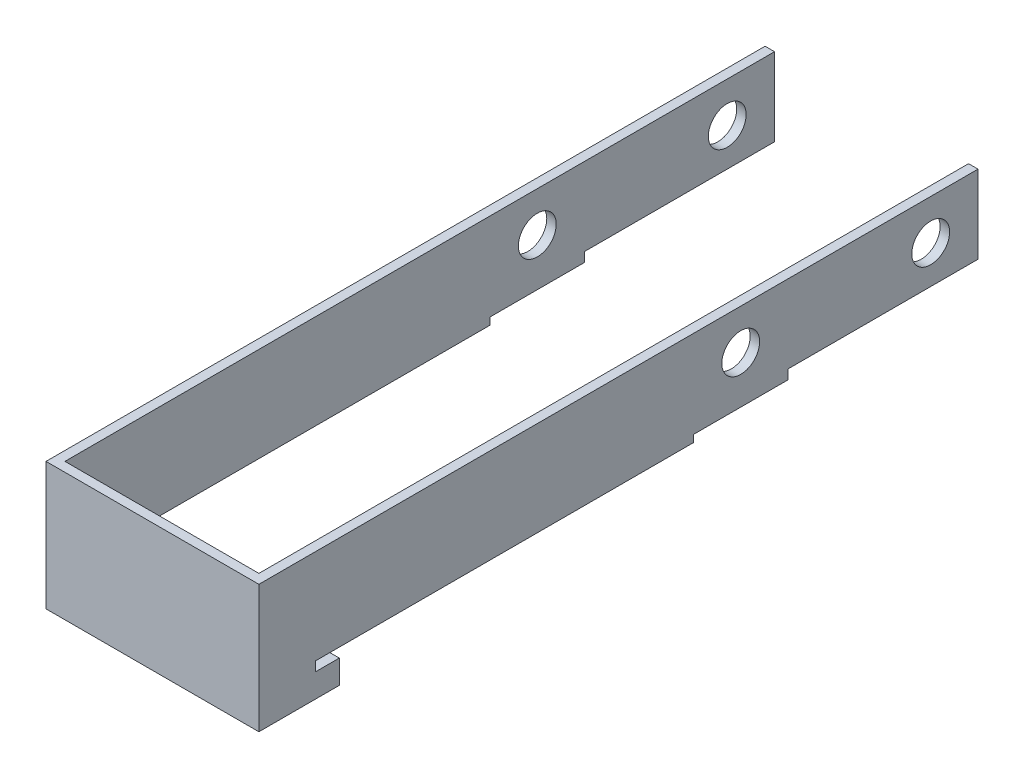
ISO-10303-21;
HEADER;
FILE_DESCRIPTION(('STEP AP214'),'2;1');
FILE_NAME('part.step','',(''),(''),'','','');
FILE_SCHEMA(('AUTOMOTIVE_DESIGN { 1 0 10303 214 1 1 1 1 }'));
ENDSEC;
DATA;
#1=APPLICATION_CONTEXT('core data for automotive mechanical design processes');
#2=APPLICATION_PROTOCOL_DEFINITION('international standard','automotive_design',2000,#1);
#3=PRODUCT_CONTEXT('',#1,'mechanical');
#4=PRODUCT('Part','Part','',(#3));
#5=PRODUCT_RELATED_PRODUCT_CATEGORY('part','',(#4));
#6=PRODUCT_DEFINITION_FORMATION('','',#4);
#7=PRODUCT_DEFINITION_CONTEXT('part definition',#1,'design');
#8=PRODUCT_DEFINITION('design','',#6,#7);
#9=PRODUCT_DEFINITION_SHAPE('','',#8);
#10=(LENGTH_UNIT() NAMED_UNIT(*) SI_UNIT(.MILLI.,.METRE.));
#11=(NAMED_UNIT(*) PLANE_ANGLE_UNIT() SI_UNIT($,.RADIAN.));
#12=(NAMED_UNIT(*) SI_UNIT($,.STERADIAN.) SOLID_ANGLE_UNIT());
#13=UNCERTAINTY_MEASURE_WITH_UNIT(LENGTH_MEASURE(1.E-05),#10,'distance_accuracy_value','');
#14=(GEOMETRIC_REPRESENTATION_CONTEXT(3) GLOBAL_UNCERTAINTY_ASSIGNED_CONTEXT((#13)) GLOBAL_UNIT_ASSIGNED_CONTEXT((#10,
#11,#12)) REPRESENTATION_CONTEXT('',''));
#15=CARTESIAN_POINT('',(0.,0.,0.));
#16=DIRECTION('',(0.,0.,1.));
#17=DIRECTION('',(1.,0.,0.));
#18=AXIS2_PLACEMENT_3D('',#15,#16,#17);
#19=CARTESIAN_POINT('',(0.,0.,140.));
#20=DIRECTION('',(0.,0.,1.));
#21=DIRECTION('',(1.,0.,0.));
#22=AXIS2_PLACEMENT_3D('',#19,#20,#21);
#23=PLANE('',#22);
#24=DIRECTION('',(0.,-1.,0.));
#25=VECTOR('',#24,1.);
#26=CARTESIAN_POINT('',(-43.000000000002,8.5,140.));
#27=LINE('',#26,#25);
#28=CARTESIAN_POINT('',(-43.000000000002,8.5,140.));
#29=VERTEX_POINT('',#28);
#30=CARTESIAN_POINT('',(-43.000000000002,-18.5,140.));
#31=VERTEX_POINT('',#30);
#32=EDGE_CURVE('E438',#29,#31,#27,.T.);
#33=ORIENTED_EDGE('',*,*,#32,.F.);
#34=DIRECTION('',(-1.,0.,0.));
#35=VECTOR('',#34,1.);
#36=CARTESIAN_POINT('',(-45.000000000002,8.5,140.));
#37=LINE('',#36,#35);
#38=CARTESIAN_POINT('',(-2.,8.5,140.));
#39=VERTEX_POINT('',#38);
#40=EDGE_CURVE('E315',#39,#29,#37,.T.);
#41=ORIENTED_EDGE('',*,*,#40,.F.);
#42=DIRECTION('',(0.,-1.,0.));
#43=VECTOR('',#42,1.);
#44=CARTESIAN_POINT('',(-2.,8.5,140.));
#45=LINE('',#44,#43);
#46=CARTESIAN_POINT('',(-2.00000000000002,-18.5,140.));
#47=VERTEX_POINT('',#46);
#48=EDGE_CURVE('E268',#39,#47,#45,.T.);
#49=ORIENTED_EDGE('',*,*,#48,.T.);
#50=DIRECTION('',(1.,0.,0.));
#51=VECTOR('',#50,1.);
#52=CARTESIAN_POINT('',(-45.000000000002,-18.5,140.));
#53=LINE('',#52,#51);
#54=EDGE_CURVE('E321',#31,#47,#53,.T.);
#55=ORIENTED_EDGE('',*,*,#54,.F.);
#56=EDGE_LOOP('',(#33,#41,#49,#55));
#57=FACE_BOUND('',#56,.T.);
#58=ADVANCED_FACE('F39',(#57),#23,.F.);
#59=CARTESIAN_POINT('',(-2.,-8.,-10.));
#60=DIRECTION('',(0.,0.,-1.));
#61=DIRECTION('',(-1.,0.,0.));
#62=AXIS2_PLACEMENT_3D('',#59,#60,#61);
#63=PLANE('',#62);
#64=DIRECTION('',(0.,1.,0.));
#65=VECTOR('',#64,1.);
#66=CARTESIAN_POINT('',(0.,-8.,-10.));
#67=LINE('',#66,#65);
#68=CARTESIAN_POINT('',(0.,-8.,-10.));
#69=VERTEX_POINT('',#68);
#70=CARTESIAN_POINT('',(0.,8.5,-10.));
#71=VERTEX_POINT('',#70);
#72=EDGE_CURVE('E155',#69,#71,#67,.T.);
#73=ORIENTED_EDGE('',*,*,#72,.F.);
#74=DIRECTION('',(1.,0.,0.));
#75=VECTOR('',#74,1.);
#76=CARTESIAN_POINT('',(-2.,-8.,-10.));
#77=LINE('',#76,#75);
#78=CARTESIAN_POINT('',(-2.,-8.,-10.));
#79=VERTEX_POINT('',#78);
#80=EDGE_CURVE('E11',#79,#69,#77,.T.);
#81=ORIENTED_EDGE('',*,*,#80,.F.);
#82=DIRECTION('',(0.,1.,0.));
#83=VECTOR('',#82,1.);
#84=CARTESIAN_POINT('',(-2.,-8.,-10.));
#85=LINE('',#84,#83);
#86=CARTESIAN_POINT('',(-2.,8.5,-10.));
#87=VERTEX_POINT('',#86);
#88=EDGE_CURVE('E185',#79,#87,#85,.T.);
#89=ORIENTED_EDGE('',*,*,#88,.T.);
#90=DIRECTION('',(1.,0.,0.));
#91=VECTOR('',#90,1.);
#92=CARTESIAN_POINT('',(-2.,8.5,-10.));
#93=LINE('',#92,#91);
#94=EDGE_CURVE('E43',#87,#71,#93,.T.);
#95=ORIENTED_EDGE('',*,*,#94,.T.);
#96=EDGE_LOOP('',(#73,#81,#89,#95));
#97=FACE_BOUND('',#96,.T.);
#98=ADVANCED_FACE('F41',(#97),#63,.T.);
#99=CARTESIAN_POINT('',(-2.,-8.,30.1527935017339));
#100=DIRECTION('',(0.,-1.,0.));
#101=DIRECTION('',(0.,0.,-1.));
#102=AXIS2_PLACEMENT_3D('',#99,#100,#101);
#103=PLANE('',#102);
#104=DIRECTION('',(0.,0.,-1.));
#105=VECTOR('',#104,1.);
#106=CARTESIAN_POINT('',(0.,-8.,30.1527935017339));
#107=LINE('',#106,#105);
#108=CARTESIAN_POINT('',(0.,-8.,30.1527935017339));
#109=VERTEX_POINT('',#108);
#110=EDGE_CURVE('E183',#109,#69,#107,.T.);
#111=ORIENTED_EDGE('',*,*,#110,.F.);
#112=DIRECTION('',(1.,0.,0.));
#113=VECTOR('',#112,1.);
#114=CARTESIAN_POINT('',(-2.,-8.,30.1527935017339));
#115=LINE('',#114,#113);
#116=CARTESIAN_POINT('',(-2.,-8.,30.1527935017339));
#117=VERTEX_POINT('',#116);
#118=EDGE_CURVE('E49',#117,#109,#115,.T.);
#119=ORIENTED_EDGE('',*,*,#118,.F.);
#120=DIRECTION('',(0.,0.,-1.));
#121=VECTOR('',#120,1.);
#122=CARTESIAN_POINT('',(-2.,-8.,30.1527935017339));
#123=LINE('',#122,#121);
#124=EDGE_CURVE('E145',#117,#79,#123,.T.);
#125=ORIENTED_EDGE('',*,*,#124,.T.);
#126=ORIENTED_EDGE('',*,*,#80,.T.);
#127=EDGE_LOOP('',(#111,#119,#125,#126));
#128=FACE_BOUND('',#127,.T.);
#129=ADVANCED_FACE('F211',(#128),#103,.T.);
#130=CARTESIAN_POINT('',(-2.,-10.,30.1527935017339));
#131=DIRECTION('',(0.,0.,-1.));
#132=DIRECTION('',(-1.,0.,0.));
#133=AXIS2_PLACEMENT_3D('',#130,#131,#132);
#134=PLANE('',#133);
#135=DIRECTION('',(0.,1.,0.));
#136=VECTOR('',#135,1.);
#137=CARTESIAN_POINT('',(0.,-10.,30.1527935017339));
#138=LINE('',#137,#136);
#139=CARTESIAN_POINT('',(0.,-10.,30.1527935017339));
#140=VERTEX_POINT('',#139);
#141=EDGE_CURVE('E132',#140,#109,#138,.T.);
#142=ORIENTED_EDGE('',*,*,#141,.F.);
#143=DIRECTION('',(1.,0.,0.));
#144=VECTOR('',#143,1.);
#145=CARTESIAN_POINT('',(-2.,-10.,30.1527935017339));
#146=LINE('',#145,#144);
#147=CARTESIAN_POINT('',(-2.,-10.,30.1527935017339));
#148=VERTEX_POINT('',#147);
#149=EDGE_CURVE('E127',#148,#140,#146,.T.);
#150=ORIENTED_EDGE('',*,*,#149,.F.);
#151=DIRECTION('',(0.,1.,0.));
#152=VECTOR('',#151,1.);
#153=CARTESIAN_POINT('',(-2.,-10.,30.1527935017339));
#154=LINE('',#153,#152);
#155=EDGE_CURVE('E130',#148,#117,#154,.T.);
#156=ORIENTED_EDGE('',*,*,#155,.T.);
#157=ORIENTED_EDGE('',*,*,#118,.T.);
#158=EDGE_LOOP('',(#142,#150,#156,#157));
#159=FACE_BOUND('',#158,.T.);
#160=ADVANCED_FACE('F129',(#159),#134,.T.);
#161=CARTESIAN_POINT('',(-2.,-10.,50.1527935017339));
#162=DIRECTION('',(0.,-1.,0.));
#163=DIRECTION('',(0.,0.,-1.));
#164=AXIS2_PLACEMENT_3D('',#161,#162,#163);
#165=PLANE('',#164);
#166=DIRECTION('',(0.,0.,-1.));
#167=VECTOR('',#166,1.);
#168=CARTESIAN_POINT('',(0.,-10.,50.1527935017339));
#169=LINE('',#168,#167);
#170=CARTESIAN_POINT('',(0.,-10.,50.1527935017339));
#171=VERTEX_POINT('',#170);
#172=EDGE_CURVE('E180',#171,#140,#169,.T.);
#173=ORIENTED_EDGE('',*,*,#172,.F.);
#174=DIRECTION('',(1.,0.,0.));
#175=VECTOR('',#174,1.);
#176=CARTESIAN_POINT('',(-2.,-10.,50.1527935017339));
#177=LINE('',#176,#175);
#178=CARTESIAN_POINT('',(-2.,-10.,50.1527935017339));
#179=VERTEX_POINT('',#178);
#180=EDGE_CURVE('E137',#179,#171,#177,.T.);
#181=ORIENTED_EDGE('',*,*,#180,.F.);
#182=DIRECTION('',(0.,0.,-1.));
#183=VECTOR('',#182,1.);
#184=CARTESIAN_POINT('',(-2.,-10.,50.1527935017339));
#185=LINE('',#184,#183);
#186=EDGE_CURVE('E143',#179,#148,#185,.T.);
#187=ORIENTED_EDGE('',*,*,#186,.T.);
#188=ORIENTED_EDGE('',*,*,#149,.T.);
#189=EDGE_LOOP('',(#173,#181,#187,#188));
#190=FACE_BOUND('',#189,.T.);
#191=ADVANCED_FACE('F147',(#190),#165,.T.);
#192=CARTESIAN_POINT('',(-2.,-11.5,50.1527935017339));
#193=DIRECTION('',(0.,0.,-1.));
#194=DIRECTION('',(-1.,0.,0.));
#195=AXIS2_PLACEMENT_3D('',#192,#193,#194);
#196=PLANE('',#195);
#197=DIRECTION('',(0.,1.,0.));
#198=VECTOR('',#197,1.);
#199=CARTESIAN_POINT('',(0.,-11.5,50.1527935017339));
#200=LINE('',#199,#198);
#201=CARTESIAN_POINT('',(0.,-11.5,50.1527935017339));
#202=VERTEX_POINT('',#201);
#203=EDGE_CURVE('E177',#202,#171,#200,.T.);
#204=ORIENTED_EDGE('',*,*,#203,.F.);
#205=DIRECTION('',(1.,0.,0.));
#206=VECTOR('',#205,1.);
#207=CARTESIAN_POINT('',(-2.,-11.5,50.1527935017339));
#208=LINE('',#207,#206);
#209=CARTESIAN_POINT('',(-2.,-11.5,50.1527935017339));
#210=VERTEX_POINT('',#209);
#211=EDGE_CURVE('E189',#210,#202,#208,.T.);
#212=ORIENTED_EDGE('',*,*,#211,.F.);
#213=DIRECTION('',(0.,1.,0.));
#214=VECTOR('',#213,1.);
#215=CARTESIAN_POINT('',(-2.,-11.5,50.1527935017339));
#216=LINE('',#215,#214);
#217=EDGE_CURVE('E148',#210,#179,#216,.T.);
#218=ORIENTED_EDGE('',*,*,#217,.T.);
#219=ORIENTED_EDGE('',*,*,#180,.T.);
#220=EDGE_LOOP('',(#204,#212,#218,#219));
#221=FACE_BOUND('',#220,.T.);
#222=ADVANCED_FACE('F732',(#221),#196,.T.);
#223=CARTESIAN_POINT('',(-2.,-11.5,130.));
#224=DIRECTION('',(0.,-1.,0.));
#225=DIRECTION('',(0.,0.,-1.));
#226=AXIS2_PLACEMENT_3D('',#223,#224,#225);
#227=PLANE('',#226);
#228=DIRECTION('',(0.,0.,-1.));
#229=VECTOR('',#228,1.);
#230=CARTESIAN_POINT('',(0.,-11.5,130.));
#231=LINE('',#230,#229);
#232=CARTESIAN_POINT('',(0.,-11.5,130.));
#233=VERTEX_POINT('',#232);
#234=EDGE_CURVE('E174',#233,#202,#231,.T.);
#235=ORIENTED_EDGE('',*,*,#234,.F.);
#236=DIRECTION('',(1.,0.,0.));
#237=VECTOR('',#236,1.);
#238=CARTESIAN_POINT('',(-2.,-11.5,130.));
#239=LINE('',#238,#237);
#240=CARTESIAN_POINT('',(-2.,-11.5,130.));
#241=VERTEX_POINT('',#240);
#242=EDGE_CURVE('E191',#241,#233,#239,.T.);
#243=ORIENTED_EDGE('',*,*,#242,.F.);
#244=DIRECTION('',(0.,0.,-1.));
#245=VECTOR('',#244,1.);
#246=CARTESIAN_POINT('',(-2.,-11.5,130.));
#247=LINE('',#246,#245);
#248=EDGE_CURVE('E150',#241,#210,#247,.T.);
#249=ORIENTED_EDGE('',*,*,#248,.T.);
#250=ORIENTED_EDGE('',*,*,#211,.T.);
#251=EDGE_LOOP('',(#235,#243,#249,#250));
#252=FACE_BOUND('',#251,.T.);
#253=ADVANCED_FACE('F285',(#252),#227,.T.);
#254=CARTESIAN_POINT('',(-2.,-13.5,130.));
#255=DIRECTION('',(0.,0.,-1.));
#256=DIRECTION('',(-1.,0.,0.));
#257=AXIS2_PLACEMENT_3D('',#254,#255,#256);
#258=PLANE('',#257);
#259=DIRECTION('',(0.,1.,0.));
#260=VECTOR('',#259,1.);
#261=CARTESIAN_POINT('',(0.,-13.5,130.));
#262=LINE('',#261,#260);
#263=CARTESIAN_POINT('',(0.,-13.5,130.));
#264=VERTEX_POINT('',#263);
#265=EDGE_CURVE('E171',#264,#233,#262,.T.);
#266=ORIENTED_EDGE('',*,*,#265,.F.);
#267=DIRECTION('',(1.,0.,0.));
#268=VECTOR('',#267,1.);
#269=CARTESIAN_POINT('',(-2.,-13.5,130.));
#270=LINE('',#269,#268);
#271=CARTESIAN_POINT('',(-2.,-13.5,130.));
#272=VERTEX_POINT('',#271);
#273=EDGE_CURVE('E193',#272,#264,#270,.T.);
#274=ORIENTED_EDGE('',*,*,#273,.F.);
#275=DIRECTION('',(0.,1.,0.));
#276=VECTOR('',#275,1.);
#277=CARTESIAN_POINT('',(-2.,-13.5,130.));
#278=LINE('',#277,#276);
#279=EDGE_CURVE('E279',#272,#241,#278,.T.);
#280=ORIENTED_EDGE('',*,*,#279,.T.);
#281=ORIENTED_EDGE('',*,*,#242,.T.);
#282=EDGE_LOOP('',(#266,#274,#280,#281));
#283=FACE_BOUND('',#282,.T.);
#284=ADVANCED_FACE('F291',(#283),#258,.T.);
#285=CARTESIAN_POINT('',(-2.,-13.5,125.));
#286=DIRECTION('',(0.,1.,0.));
#287=DIRECTION('',(0.,0.,1.));
#288=AXIS2_PLACEMENT_3D('',#285,#286,#287);
#289=PLANE('',#288);
#290=DIRECTION('',(0.,0.,1.));
#291=VECTOR('',#290,1.);
#292=CARTESIAN_POINT('',(0.,-13.5,125.));
#293=LINE('',#292,#291);
#294=CARTESIAN_POINT('',(0.,-13.5,125.));
#295=VERTEX_POINT('',#294);
#296=EDGE_CURVE('E168',#295,#264,#293,.T.);
#297=ORIENTED_EDGE('',*,*,#296,.F.);
#298=DIRECTION('',(1.,0.,0.));
#299=VECTOR('',#298,1.);
#300=CARTESIAN_POINT('',(-2.,-13.5,125.));
#301=LINE('',#300,#299);
#302=CARTESIAN_POINT('',(-2.,-13.5,125.));
#303=VERTEX_POINT('',#302);
#304=EDGE_CURVE('E195',#303,#295,#301,.T.);
#305=ORIENTED_EDGE('',*,*,#304,.F.);
#306=DIRECTION('',(0.,0.,1.));
#307=VECTOR('',#306,1.);
#308=CARTESIAN_POINT('',(-2.,-13.5,125.));
#309=LINE('',#308,#307);
#310=EDGE_CURVE('E276',#303,#272,#309,.T.);
#311=ORIENTED_EDGE('',*,*,#310,.T.);
#312=ORIENTED_EDGE('',*,*,#273,.T.);
#313=EDGE_LOOP('',(#297,#305,#311,#312));
#314=FACE_BOUND('',#313,.T.);
#315=ADVANCED_FACE('F294',(#314),#289,.T.);
#316=CARTESIAN_POINT('',(-2.,-18.5,125.));
#317=DIRECTION('',(0.,0.,-1.));
#318=DIRECTION('',(-1.,0.,0.));
#319=AXIS2_PLACEMENT_3D('',#316,#317,#318);
#320=PLANE('',#319);
#321=DIRECTION('',(0.,1.,0.));
#322=VECTOR('',#321,1.);
#323=CARTESIAN_POINT('',(0.,-18.5,125.));
#324=LINE('',#323,#322);
#325=CARTESIAN_POINT('',(0.,-18.5,125.));
#326=VERTEX_POINT('',#325);
#327=EDGE_CURVE('E165',#326,#295,#324,.T.);
#328=ORIENTED_EDGE('',*,*,#327,.F.);
#329=DIRECTION('',(1.,0.,0.));
#330=VECTOR('',#329,1.);
#331=CARTESIAN_POINT('',(-2.,-18.5,125.));
#332=LINE('',#331,#330);
#333=CARTESIAN_POINT('',(-2.,-18.5,125.));
#334=VERTEX_POINT('',#333);
#335=EDGE_CURVE('E196',#334,#326,#332,.T.);
#336=ORIENTED_EDGE('',*,*,#335,.F.);
#337=DIRECTION('',(0.,1.,0.));
#338=VECTOR('',#337,1.);
#339=CARTESIAN_POINT('',(-2.,-18.5,125.));
#340=LINE('',#339,#338);
#341=EDGE_CURVE('E273',#334,#303,#340,.T.);
#342=ORIENTED_EDGE('',*,*,#341,.T.);
#343=ORIENTED_EDGE('',*,*,#304,.T.);
#344=EDGE_LOOP('',(#328,#336,#342,#343));
#345=FACE_BOUND('',#344,.T.);
#346=ADVANCED_FACE('F298',(#345),#320,.T.);
#347=CARTESIAN_POINT('',(-2.,-18.5,140.));
#348=DIRECTION('',(0.,-1.,0.));
#349=DIRECTION('',(0.,0.,-1.));
#350=AXIS2_PLACEMENT_3D('',#347,#348,#349);
#351=PLANE('',#350);
#352=DIRECTION('',(0.,0.,-1.));
#353=VECTOR('',#352,1.);
#354=CARTESIAN_POINT('',(0.,-18.5,140.));
#355=LINE('',#354,#353);
#356=CARTESIAN_POINT('',(0.,-18.5,142.));
#357=VERTEX_POINT('',#356);
#358=EDGE_CURVE('E162',#357,#326,#355,.T.);
#359=ORIENTED_EDGE('',*,*,#358,.F.);
#360=DIRECTION('',(1.,0.,0.));
#361=VECTOR('',#360,1.);
#362=CARTESIAN_POINT('',(-45.000000000002,-18.5,142.));
#363=LINE('',#362,#361);
#364=CARTESIAN_POINT('',(-45.000000000002,-18.5,142.));
#365=VERTEX_POINT('',#364);
#366=EDGE_CURVE('E306',#365,#357,#363,.T.);
#367=ORIENTED_EDGE('',*,*,#366,.F.);
#368=DIRECTION('',(0.,0.,-1.));
#369=VECTOR('',#368,1.);
#370=CARTESIAN_POINT('',(-45.000000000002,-18.5,142.));
#371=LINE('',#370,#369);
#372=CARTESIAN_POINT('',(-45.0000000000017,-18.5,125.));
#373=VERTEX_POINT('',#372);
#374=EDGE_CURVE('E329',#365,#373,#371,.T.);
#375=ORIENTED_EDGE('',*,*,#374,.T.);
#376=DIRECTION('',(-1.,0.,0.));
#377=VECTOR('',#376,1.);
#378=CARTESIAN_POINT('',(-43.0000000000017,-18.5,125.));
#379=LINE('',#378,#377);
#380=CARTESIAN_POINT('',(-43.0000000000017,-18.5,125.));
#381=VERTEX_POINT('',#380);
#382=EDGE_CURVE('E336',#381,#373,#379,.T.);
#383=ORIENTED_EDGE('',*,*,#382,.F.);
#384=DIRECTION('',(0.,0.,-1.));
#385=VECTOR('',#384,1.);
#386=CARTESIAN_POINT('',(-43.000000000002,-18.5,140.));
#387=LINE('',#386,#385);
#388=EDGE_CURVE('E435',#31,#381,#387,.T.);
#389=ORIENTED_EDGE('',*,*,#388,.F.);
#390=ORIENTED_EDGE('',*,*,#54,.T.);
#391=DIRECTION('',(0.,0.,-1.));
#392=VECTOR('',#391,1.);
#393=CARTESIAN_POINT('',(-2.,-18.5,140.));
#394=LINE('',#393,#392);
#395=EDGE_CURVE('E271',#47,#334,#394,.T.);
#396=ORIENTED_EDGE('',*,*,#395,.T.);
#397=ORIENTED_EDGE('',*,*,#335,.T.);
#398=EDGE_LOOP('',(#359,#367,#375,#383,#389,#390,#396,#397));
#399=FACE_BOUND('',#398,.T.);
#400=ADVANCED_FACE('F303',(#399),#351,.T.);
#401=CARTESIAN_POINT('',(-2.,8.5,-10.));
#402=DIRECTION('',(0.,1.,0.));
#403=DIRECTION('',(0.,0.,1.));
#404=AXIS2_PLACEMENT_3D('',#401,#402,#403);
#405=PLANE('',#404);
#406=DIRECTION('',(0.,0.,1.));
#407=VECTOR('',#406,1.);
#408=CARTESIAN_POINT('',(0.,8.5,-10.));
#409=LINE('',#408,#407);
#410=CARTESIAN_POINT('',(0.,8.5,142.));
#411=VERTEX_POINT('',#410);
#412=EDGE_CURVE('E158',#71,#411,#409,.T.);
#413=ORIENTED_EDGE('',*,*,#412,.F.);
#414=ORIENTED_EDGE('',*,*,#94,.F.);
#415=DIRECTION('',(0.,0.,1.));
#416=VECTOR('',#415,1.);
#417=CARTESIAN_POINT('',(-2.,8.5,-10.));
#418=LINE('',#417,#416);
#419=EDGE_CURVE('E266',#87,#39,#418,.T.);
#420=ORIENTED_EDGE('',*,*,#419,.T.);
#421=ORIENTED_EDGE('',*,*,#40,.T.);
#422=DIRECTION('',(0.,0.,1.));
#423=VECTOR('',#422,1.);
#424=CARTESIAN_POINT('',(-42.9999999999999,8.5,-10.0000000000003));
#425=LINE('',#424,#423);
#426=CARTESIAN_POINT('',(-42.9999999999999,8.5,-10.0000000000003));
#427=VERTEX_POINT('',#426);
#428=EDGE_CURVE('E441',#427,#29,#425,.T.);
#429=ORIENTED_EDGE('',*,*,#428,.F.);
#430=DIRECTION('',(-1.,0.,0.));
#431=VECTOR('',#430,1.);
#432=CARTESIAN_POINT('',(-42.9999999999999,8.5,-10.0000000000003));
#433=LINE('',#432,#431);
#434=CARTESIAN_POINT('',(-44.9999999999999,8.5,-10.0000000000003));
#435=VERTEX_POINT('',#434);
#436=EDGE_CURVE('E351',#427,#435,#433,.T.);
#437=ORIENTED_EDGE('',*,*,#436,.T.);
#438=DIRECTION('',(0.,0.,-1.));
#439=VECTOR('',#438,1.);
#440=CARTESIAN_POINT('',(-45.000000000002,8.5,142.));
#441=LINE('',#440,#439);
#442=CARTESIAN_POINT('',(-45.000000000002,8.5,142.));
#443=VERTEX_POINT('',#442);
#444=EDGE_CURVE('E320',#443,#435,#441,.T.);
#445=ORIENTED_EDGE('',*,*,#444,.F.);
#446=DIRECTION('',(-1.,0.,0.));
#447=VECTOR('',#446,1.);
#448=CARTESIAN_POINT('',(-45.000000000002,8.5,142.));
#449=LINE('',#448,#447);
#450=EDGE_CURVE('E206',#411,#443,#449,.T.);
#451=ORIENTED_EDGE('',*,*,#450,.F.);
#452=EDGE_LOOP('',(#413,#414,#420,#421,#429,#437,#445,#451));
#453=FACE_BOUND('',#452,.T.);
#454=ADVANCED_FACE('F202',(#453),#405,.T.);
#455=CARTESIAN_POINT('',(-2.,0.,0.));
#456=DIRECTION('',(1.,0.,0.));
#457=DIRECTION('',(0.,0.,-1.));
#458=AXIS2_PLACEMENT_3D('',#455,#456,#457);
#459=PLANE('',#458);
#460=CARTESIAN_POINT('',(-2.,0.,40.1527935017339));
#461=DIRECTION('',(1.,0.,0.));
#462=DIRECTION('',(0.,0.,-1.));
#463=AXIS2_PLACEMENT_3D('',#460,#461,#462);
#464=CIRCLE('',#463,4.);
#465=CARTESIAN_POINT('',(-2.,0.,36.1527935017339));
#466=VERTEX_POINT('',#465);
#467=EDGE_CURVE('E257',#466,#466,#464,.T.);
#468=ORIENTED_EDGE('',*,*,#467,.T.);
#469=EDGE_LOOP('',(#468));
#470=FACE_BOUND('',#469,.T.);
#471=CARTESIAN_POINT('',(-2.,0.,0.));
#472=DIRECTION('',(1.,0.,0.));
#473=DIRECTION('',(0.,0.,-1.));
#474=AXIS2_PLACEMENT_3D('',#471,#472,#473);
#475=CIRCLE('',#474,4.);
#476=CARTESIAN_POINT('',(-2.,0.,-4.));
#477=VERTEX_POINT('',#476);
#478=EDGE_CURVE('E159',#477,#477,#475,.T.);
#479=ORIENTED_EDGE('',*,*,#478,.T.);
#480=EDGE_LOOP('',(#479));
#481=FACE_BOUND('',#480,.T.);
#482=ORIENTED_EDGE('',*,*,#88,.F.);
#483=ORIENTED_EDGE('',*,*,#124,.F.);
#484=ORIENTED_EDGE('',*,*,#155,.F.);
#485=ORIENTED_EDGE('',*,*,#186,.F.);
#486=ORIENTED_EDGE('',*,*,#217,.F.);
#487=ORIENTED_EDGE('',*,*,#248,.F.);
#488=ORIENTED_EDGE('',*,*,#279,.F.);
#489=ORIENTED_EDGE('',*,*,#310,.F.);
#490=ORIENTED_EDGE('',*,*,#341,.F.);
#491=ORIENTED_EDGE('',*,*,#395,.F.);
#492=ORIENTED_EDGE('',*,*,#48,.F.);
#493=ORIENTED_EDGE('',*,*,#419,.F.);
#494=EDGE_LOOP('',(#482,#483,#484,#485,#486,#487,#488,#489,#490,#491,#492,#493));
#495=FACE_BOUND('',#494,.T.);
#496=ADVANCED_FACE('F141',(#470,#481,#495),#459,.F.);
#497=CARTESIAN_POINT('',(0.,0.,0.));
#498=DIRECTION('',(1.,0.,0.));
#499=DIRECTION('',(0.,0.,-1.));
#500=AXIS2_PLACEMENT_3D('',#497,#498,#499);
#501=PLANE('',#500);
#502=CARTESIAN_POINT('',(0.,0.,40.1527935017339));
#503=DIRECTION('',(1.,0.,0.));
#504=DIRECTION('',(0.,0.,-1.));
#505=AXIS2_PLACEMENT_3D('',#502,#503,#504);
#506=CIRCLE('',#505,4.);
#507=CARTESIAN_POINT('',(0.,0.,36.1527935017339));
#508=VERTEX_POINT('',#507);
#509=EDGE_CURVE('E252',#508,#508,#506,.T.);
#510=ORIENTED_EDGE('',*,*,#509,.F.);
#511=EDGE_LOOP('',(#510));
#512=FACE_BOUND('',#511,.T.);
#513=CARTESIAN_POINT('',(0.,0.,0.));
#514=DIRECTION('',(1.,0.,0.));
#515=DIRECTION('',(0.,0.,-1.));
#516=AXIS2_PLACEMENT_3D('',#513,#514,#515);
#517=CIRCLE('',#516,4.);
#518=CARTESIAN_POINT('',(0.,0.,-4.));
#519=VERTEX_POINT('',#518);
#520=EDGE_CURVE('E255',#519,#519,#517,.T.);
#521=ORIENTED_EDGE('',*,*,#520,.F.);
#522=EDGE_LOOP('',(#521));
#523=FACE_BOUND('',#522,.T.);
#524=ORIENTED_EDGE('',*,*,#72,.T.);
#525=ORIENTED_EDGE('',*,*,#412,.T.);
#526=DIRECTION('',(0.,1.,0.));
#527=VECTOR('',#526,1.);
#528=CARTESIAN_POINT('',(0.,8.5,142.));
#529=LINE('',#528,#527);
#530=EDGE_CURVE('E300',#357,#411,#529,.T.);
#531=ORIENTED_EDGE('',*,*,#530,.F.);
#532=ORIENTED_EDGE('',*,*,#358,.T.);
#533=ORIENTED_EDGE('',*,*,#327,.T.);
#534=ORIENTED_EDGE('',*,*,#296,.T.);
#535=ORIENTED_EDGE('',*,*,#265,.T.);
#536=ORIENTED_EDGE('',*,*,#234,.T.);
#537=ORIENTED_EDGE('',*,*,#203,.T.);
#538=ORIENTED_EDGE('',*,*,#172,.T.);
#539=ORIENTED_EDGE('',*,*,#141,.T.);
#540=ORIENTED_EDGE('',*,*,#110,.T.);
#541=EDGE_LOOP('',(#524,#525,#531,#532,#533,#534,#535,#536,#537,#538,#539,#540));
#542=FACE_BOUND('',#541,.T.);
#543=ADVANCED_FACE('F210',(#512,#523,#542),#501,.T.);
#544=CARTESIAN_POINT('',(-2.,0.,0.));
#545=DIRECTION('',(1.,0.,0.));
#546=DIRECTION('',(0.,0.,-1.));
#547=AXIS2_PLACEMENT_3D('',#544,#545,#546);
#548=CYLINDRICAL_SURFACE('',#547,4.);
#549=ORIENTED_EDGE('',*,*,#478,.F.);
#550=EDGE_LOOP('',(#549));
#551=FACE_BOUND('',#550,.T.);
#552=ORIENTED_EDGE('',*,*,#520,.T.);
#553=EDGE_LOOP('',(#552));
#554=FACE_BOUND('',#553,.T.);
#555=ADVANCED_FACE('F238',(#551,#554),#548,.F.);
#556=CARTESIAN_POINT('',(-2.,0.,40.1527935017339));
#557=DIRECTION('',(1.,0.,0.));
#558=DIRECTION('',(0.,0.,-1.));
#559=AXIS2_PLACEMENT_3D('',#556,#557,#558);
#560=CYLINDRICAL_SURFACE('',#559,4.);
#561=ORIENTED_EDGE('',*,*,#467,.F.);
#562=EDGE_LOOP('',(#561));
#563=FACE_BOUND('',#562,.T.);
#564=ORIENTED_EDGE('',*,*,#509,.T.);
#565=EDGE_LOOP('',(#564));
#566=FACE_BOUND('',#565,.T.);
#567=ADVANCED_FACE('F235',(#563,#566),#560,.F.);
#568=CARTESIAN_POINT('',(-45.000000000002,8.5,142.));
#569=DIRECTION('',(1.,0.,0.));
#570=DIRECTION('',(0.,0.,-1.));
#571=AXIS2_PLACEMENT_3D('',#568,#569,#570);
#572=PLANE('',#571);
#573=ORIENTED_EDGE('',*,*,#444,.T.);
#574=DIRECTION('',(0.,1.,0.));
#575=VECTOR('',#574,1.);
#576=CARTESIAN_POINT('',(-44.9999999999999,-8.,-10.0000000000003));
#577=LINE('',#576,#575);
#578=CARTESIAN_POINT('',(-44.9999999999999,-8.,-10.0000000000003));
#579=VERTEX_POINT('',#578);
#580=EDGE_CURVE('E358',#579,#435,#577,.T.);
#581=ORIENTED_EDGE('',*,*,#580,.F.);
#582=DIRECTION('',(0.,0.,-1.));
#583=VECTOR('',#582,1.);
#584=CARTESIAN_POINT('',(-45.0000000000004,-8.,30.1527935017336));
#585=LINE('',#584,#583);
#586=CARTESIAN_POINT('',(-45.0000000000004,-8.,30.1527935017336));
#587=VERTEX_POINT('',#586);
#588=EDGE_CURVE('E381',#587,#579,#585,.T.);
#589=ORIENTED_EDGE('',*,*,#588,.F.);
#590=DIRECTION('',(0.,1.,0.));
#591=VECTOR('',#590,1.);
#592=CARTESIAN_POINT('',(-45.0000000000004,-10.,30.1527935017336));
#593=LINE('',#592,#591);
#594=CARTESIAN_POINT('',(-45.0000000000004,-10.,30.1527935017336));
#595=VERTEX_POINT('',#594);
#596=EDGE_CURVE('E378',#595,#587,#593,.T.);
#597=ORIENTED_EDGE('',*,*,#596,.F.);
#598=DIRECTION('',(0.,0.,-1.));
#599=VECTOR('',#598,1.);
#600=CARTESIAN_POINT('',(-45.0000000000007,-10.,50.1527935017336));
#601=LINE('',#600,#599);
#602=CARTESIAN_POINT('',(-45.0000000000007,-10.,50.1527935017336));
#603=VERTEX_POINT('',#602);
#604=EDGE_CURVE('E375',#603,#595,#601,.T.);
#605=ORIENTED_EDGE('',*,*,#604,.F.);
#606=DIRECTION('',(0.,1.,0.));
#607=VECTOR('',#606,1.);
#608=CARTESIAN_POINT('',(-45.0000000000007,-11.5,50.1527935017336));
#609=LINE('',#608,#607);
#610=CARTESIAN_POINT('',(-45.0000000000007,-11.5,50.1527935017336));
#611=VERTEX_POINT('',#610);
#612=EDGE_CURVE('E372',#611,#603,#609,.T.);
#613=ORIENTED_EDGE('',*,*,#612,.F.);
#614=DIRECTION('',(0.,0.,-1.));
#615=VECTOR('',#614,1.);
#616=CARTESIAN_POINT('',(-45.0000000000018,-11.5,130.));
#617=LINE('',#616,#615);
#618=CARTESIAN_POINT('',(-45.0000000000018,-11.5,130.));
#619=VERTEX_POINT('',#618);
#620=EDGE_CURVE('E369',#619,#611,#617,.T.);
#621=ORIENTED_EDGE('',*,*,#620,.F.);
#622=DIRECTION('',(0.,1.,0.));
#623=VECTOR('',#622,1.);
#624=CARTESIAN_POINT('',(-45.0000000000018,-13.5,130.));
#625=LINE('',#624,#623);
#626=CARTESIAN_POINT('',(-45.0000000000018,-13.5,130.));
#627=VERTEX_POINT('',#626);
#628=EDGE_CURVE('E360',#627,#619,#625,.T.);
#629=ORIENTED_EDGE('',*,*,#628,.F.);
#630=DIRECTION('',(0.,0.,1.));
#631=VECTOR('',#630,1.);
#632=CARTESIAN_POINT('',(-45.0000000000017,-13.5,125.));
#633=LINE('',#632,#631);
#634=CARTESIAN_POINT('',(-45.0000000000017,-13.5,125.));
#635=VERTEX_POINT('',#634);
#636=EDGE_CURVE('E357',#635,#627,#633,.T.);
#637=ORIENTED_EDGE('',*,*,#636,.F.);
#638=DIRECTION('',(0.,1.,0.));
#639=VECTOR('',#638,1.);
#640=CARTESIAN_POINT('',(-45.0000000000017,-18.5,125.));
#641=LINE('',#640,#639);
#642=EDGE_CURVE('E346',#373,#635,#641,.T.);
#643=ORIENTED_EDGE('',*,*,#642,.F.);
#644=ORIENTED_EDGE('',*,*,#374,.F.);
#645=DIRECTION('',(0.,-1.,0.));
#646=VECTOR('',#645,1.);
#647=CARTESIAN_POINT('',(-45.000000000002,8.5,142.));
#648=LINE('',#647,#646);
#649=EDGE_CURVE('E311',#443,#365,#648,.T.);
#650=ORIENTED_EDGE('',*,*,#649,.F.);
#651=EDGE_LOOP('',(#573,#581,#589,#597,#605,#613,#621,#629,#637,#643,#644,#650));
#652=FACE_BOUND('',#651,.T.);
#653=CARTESIAN_POINT('',(-45.0000000000006,0.,40.1527935017336));
#654=DIRECTION('',(1.,0.,0.));
#655=DIRECTION('',(0.,0.,-1.));
#656=AXIS2_PLACEMENT_3D('',#653,#654,#655);
#657=CIRCLE('',#656,4.);
#658=CARTESIAN_POINT('',(-45.0000000000005,0.,36.1527935017336));
#659=VERTEX_POINT('',#658);
#660=EDGE_CURVE('E451',#659,#659,#657,.T.);
#661=ORIENTED_EDGE('',*,*,#660,.T.);
#662=EDGE_LOOP('',(#661));
#663=FACE_BOUND('',#662,.T.);
#664=CARTESIAN_POINT('',(-45.,0.,-3.14233320495882E-13));
#665=DIRECTION('',(1.,0.,0.));
#666=DIRECTION('',(0.,0.,-1.));
#667=AXIS2_PLACEMENT_3D('',#664,#665,#666);
#668=CIRCLE('',#667,4.);
#669=CARTESIAN_POINT('',(-44.9999999999999,0.,-4.00000000000031));
#670=VERTEX_POINT('',#669);
#671=EDGE_CURVE('E445',#670,#670,#668,.T.);
#672=ORIENTED_EDGE('',*,*,#671,.T.);
#673=EDGE_LOOP('',(#672));
#674=FACE_BOUND('',#673,.T.);
#675=ADVANCED_FACE('F232',(#652,#663,#674),#572,.F.);
#676=CARTESIAN_POINT('',(0.,0.,142.));
#677=DIRECTION('',(0.,0.,1.));
#678=DIRECTION('',(1.,0.,0.));
#679=AXIS2_PLACEMENT_3D('',#676,#677,#678);
#680=PLANE('',#679);
#681=ORIENTED_EDGE('',*,*,#649,.T.);
#682=ORIENTED_EDGE('',*,*,#366,.T.);
#683=ORIENTED_EDGE('',*,*,#530,.T.);
#684=ORIENTED_EDGE('',*,*,#450,.T.);
#685=EDGE_LOOP('',(#681,#682,#683,#684));
#686=FACE_BOUND('',#685,.T.);
#687=ADVANCED_FACE('F230',(#686),#680,.T.);
#688=CARTESIAN_POINT('',(-42.9999999999999,-8.,-10.0000000000003));
#689=DIRECTION('',(0.,0.,-1.));
#690=DIRECTION('',(1.,0.,0.));
#691=AXIS2_PLACEMENT_3D('',#688,#689,#690);
#692=PLANE('',#691);
#693=ORIENTED_EDGE('',*,*,#580,.T.);
#694=ORIENTED_EDGE('',*,*,#436,.F.);
#695=DIRECTION('',(0.,1.,0.));
#696=VECTOR('',#695,1.);
#697=CARTESIAN_POINT('',(-42.9999999999999,-8.,-10.0000000000003));
#698=LINE('',#697,#696);
#699=CARTESIAN_POINT('',(-42.9999999999999,-8.,-10.0000000000003));
#700=VERTEX_POINT('',#699);
#701=EDGE_CURVE('E384',#700,#427,#698,.T.);
#702=ORIENTED_EDGE('',*,*,#701,.F.);
#703=DIRECTION('',(-1.,0.,0.));
#704=VECTOR('',#703,1.);
#705=CARTESIAN_POINT('',(-42.9999999999999,-8.,-10.0000000000003));
#706=LINE('',#705,#704);
#707=EDGE_CURVE('E324',#700,#579,#706,.T.);
#708=ORIENTED_EDGE('',*,*,#707,.T.);
#709=EDGE_LOOP('',(#693,#694,#702,#708));
#710=FACE_BOUND('',#709,.T.);
#711=ADVANCED_FACE('F472',(#710),#692,.T.);
#712=CARTESIAN_POINT('',(-43.0000000000004,-8.,30.1527935017336));
#713=DIRECTION('',(0.,-1.,0.));
#714=DIRECTION('',(0.,0.,-1.));
#715=AXIS2_PLACEMENT_3D('',#712,#713,#714);
#716=PLANE('',#715);
#717=ORIENTED_EDGE('',*,*,#588,.T.);
#718=ORIENTED_EDGE('',*,*,#707,.F.);
#719=DIRECTION('',(0.,0.,-1.));
#720=VECTOR('',#719,1.);
#721=CARTESIAN_POINT('',(-43.0000000000004,-8.,30.1527935017336));
#722=LINE('',#721,#720);
#723=CARTESIAN_POINT('',(-43.0000000000004,-8.,30.1527935017336));
#724=VERTEX_POINT('',#723);
#725=EDGE_CURVE('E406',#724,#700,#722,.T.);
#726=ORIENTED_EDGE('',*,*,#725,.F.);
#727=DIRECTION('',(-1.,0.,0.));
#728=VECTOR('',#727,1.);
#729=CARTESIAN_POINT('',(-43.0000000000004,-8.,30.1527935017336));
#730=LINE('',#729,#728);
#731=EDGE_CURVE('E387',#724,#587,#730,.T.);
#732=ORIENTED_EDGE('',*,*,#731,.T.);
#733=EDGE_LOOP('',(#717,#718,#726,#732));
#734=FACE_BOUND('',#733,.T.);
#735=ADVANCED_FACE('F553',(#734),#716,.T.);
#736=CARTESIAN_POINT('',(-43.0000000000004,-10.,30.1527935017336));
#737=DIRECTION('',(0.,0.,-1.));
#738=DIRECTION('',(1.,0.,0.));
#739=AXIS2_PLACEMENT_3D('',#736,#737,#738);
#740=PLANE('',#739);
#741=ORIENTED_EDGE('',*,*,#596,.T.);
#742=ORIENTED_EDGE('',*,*,#731,.F.);
#743=DIRECTION('',(0.,1.,0.));
#744=VECTOR('',#743,1.);
#745=CARTESIAN_POINT('',(-43.0000000000004,-10.,30.1527935017336));
#746=LINE('',#745,#744);
#747=CARTESIAN_POINT('',(-43.0000000000004,-10.,30.1527935017336));
#748=VERTEX_POINT('',#747);
#749=EDGE_CURVE('E410',#748,#724,#746,.T.);
#750=ORIENTED_EDGE('',*,*,#749,.F.);
#751=DIRECTION('',(-1.,0.,0.));
#752=VECTOR('',#751,1.);
#753=CARTESIAN_POINT('',(-43.0000000000004,-10.,30.1527935017336));
#754=LINE('',#753,#752);
#755=EDGE_CURVE('E390',#748,#595,#754,.T.);
#756=ORIENTED_EDGE('',*,*,#755,.T.);
#757=EDGE_LOOP('',(#741,#742,#750,#756));
#758=FACE_BOUND('',#757,.T.);
#759=ADVANCED_FACE('F525',(#758),#740,.T.);
#760=CARTESIAN_POINT('',(-43.0000000000007,-10.,50.1527935017336));
#761=DIRECTION('',(0.,-1.,0.));
#762=DIRECTION('',(0.,0.,-1.));
#763=AXIS2_PLACEMENT_3D('',#760,#761,#762);
#764=PLANE('',#763);
#765=ORIENTED_EDGE('',*,*,#604,.T.);
#766=ORIENTED_EDGE('',*,*,#755,.F.);
#767=DIRECTION('',(0.,0.,-1.));
#768=VECTOR('',#767,1.);
#769=CARTESIAN_POINT('',(-43.0000000000007,-10.,50.1527935017336));
#770=LINE('',#769,#768);
#771=CARTESIAN_POINT('',(-43.0000000000007,-10.,50.1527935017336));
#772=VERTEX_POINT('',#771);
#773=EDGE_CURVE('E417',#772,#748,#770,.T.);
#774=ORIENTED_EDGE('',*,*,#773,.F.);
#775=DIRECTION('',(-1.,0.,0.));
#776=VECTOR('',#775,1.);
#777=CARTESIAN_POINT('',(-43.0000000000007,-10.,50.1527935017336));
#778=LINE('',#777,#776);
#779=EDGE_CURVE('E393',#772,#603,#778,.T.);
#780=ORIENTED_EDGE('',*,*,#779,.T.);
#781=EDGE_LOOP('',(#765,#766,#774,#780));
#782=FACE_BOUND('',#781,.T.);
#783=ADVANCED_FACE('F519',(#782),#764,.T.);
#784=CARTESIAN_POINT('',(-43.0000000000007,-11.5,50.1527935017336));
#785=DIRECTION('',(0.,0.,-1.));
#786=DIRECTION('',(1.,0.,0.));
#787=AXIS2_PLACEMENT_3D('',#784,#785,#786);
#788=PLANE('',#787);
#789=ORIENTED_EDGE('',*,*,#612,.T.);
#790=ORIENTED_EDGE('',*,*,#779,.F.);
#791=DIRECTION('',(0.,1.,0.));
#792=VECTOR('',#791,1.);
#793=CARTESIAN_POINT('',(-43.0000000000007,-11.5,50.1527935017336));
#794=LINE('',#793,#792);
#795=CARTESIAN_POINT('',(-43.0000000000007,-11.5,50.1527935017336));
#796=VERTEX_POINT('',#795);
#797=EDGE_CURVE('E422',#796,#772,#794,.T.);
#798=ORIENTED_EDGE('',*,*,#797,.F.);
#799=DIRECTION('',(-1.,0.,0.));
#800=VECTOR('',#799,1.);
#801=CARTESIAN_POINT('',(-43.0000000000007,-11.5,50.1527935017336));
#802=LINE('',#801,#800);
#803=EDGE_CURVE('E396',#796,#611,#802,.T.);
#804=ORIENTED_EDGE('',*,*,#803,.T.);
#805=EDGE_LOOP('',(#789,#790,#798,#804));
#806=FACE_BOUND('',#805,.T.);
#807=ADVANCED_FACE('F531',(#806),#788,.T.);
#808=CARTESIAN_POINT('',(-43.0000000000018,-11.5,130.));
#809=DIRECTION('',(0.,-1.,0.));
#810=DIRECTION('',(0.,0.,-1.));
#811=AXIS2_PLACEMENT_3D('',#808,#809,#810);
#812=PLANE('',#811);
#813=ORIENTED_EDGE('',*,*,#620,.T.);
#814=ORIENTED_EDGE('',*,*,#803,.F.);
#815=DIRECTION('',(0.,0.,-1.));
#816=VECTOR('',#815,1.);
#817=CARTESIAN_POINT('',(-43.0000000000018,-11.5,130.));
#818=LINE('',#817,#816);
#819=CARTESIAN_POINT('',(-43.0000000000018,-11.5,130.));
#820=VERTEX_POINT('',#819);
#821=EDGE_CURVE('E425',#820,#796,#818,.T.);
#822=ORIENTED_EDGE('',*,*,#821,.F.);
#823=DIRECTION('',(-1.,0.,0.));
#824=VECTOR('',#823,1.);
#825=CARTESIAN_POINT('',(-43.0000000000018,-11.5,130.));
#826=LINE('',#825,#824);
#827=EDGE_CURVE('E399',#820,#619,#826,.T.);
#828=ORIENTED_EDGE('',*,*,#827,.T.);
#829=EDGE_LOOP('',(#813,#814,#822,#828));
#830=FACE_BOUND('',#829,.T.);
#831=ADVANCED_FACE('F534',(#830),#812,.T.);
#832=CARTESIAN_POINT('',(-43.0000000000018,-13.5,130.));
#833=DIRECTION('',(0.,0.,-1.));
#834=DIRECTION('',(1.,0.,0.));
#835=AXIS2_PLACEMENT_3D('',#832,#833,#834);
#836=PLANE('',#835);
#837=ORIENTED_EDGE('',*,*,#628,.T.);
#838=ORIENTED_EDGE('',*,*,#827,.F.);
#839=DIRECTION('',(0.,1.,0.));
#840=VECTOR('',#839,1.);
#841=CARTESIAN_POINT('',(-43.0000000000018,-13.5,130.));
#842=LINE('',#841,#840);
#843=CARTESIAN_POINT('',(-43.0000000000018,-13.5,130.));
#844=VERTEX_POINT('',#843);
#845=EDGE_CURVE('E428',#844,#820,#842,.T.);
#846=ORIENTED_EDGE('',*,*,#845,.F.);
#847=DIRECTION('',(-1.,0.,0.));
#848=VECTOR('',#847,1.);
#849=CARTESIAN_POINT('',(-43.0000000000018,-13.5,130.));
#850=LINE('',#849,#848);
#851=EDGE_CURVE('E402',#844,#627,#850,.T.);
#852=ORIENTED_EDGE('',*,*,#851,.T.);
#853=EDGE_LOOP('',(#837,#838,#846,#852));
#854=FACE_BOUND('',#853,.T.);
#855=ADVANCED_FACE('F538',(#854),#836,.T.);
#856=CARTESIAN_POINT('',(-43.0000000000017,-13.5,125.));
#857=DIRECTION('',(0.,1.,0.));
#858=DIRECTION('',(0.,0.,1.));
#859=AXIS2_PLACEMENT_3D('',#856,#857,#858);
#860=PLANE('',#859);
#861=ORIENTED_EDGE('',*,*,#636,.T.);
#862=ORIENTED_EDGE('',*,*,#851,.F.);
#863=DIRECTION('',(0.,0.,1.));
#864=VECTOR('',#863,1.);
#865=CARTESIAN_POINT('',(-43.0000000000017,-13.5,125.));
#866=LINE('',#865,#864);
#867=CARTESIAN_POINT('',(-43.0000000000017,-13.5,125.));
#868=VERTEX_POINT('',#867);
#869=EDGE_CURVE('E431',#868,#844,#866,.T.);
#870=ORIENTED_EDGE('',*,*,#869,.F.);
#871=DIRECTION('',(-1.,0.,0.));
#872=VECTOR('',#871,1.);
#873=CARTESIAN_POINT('',(-43.0000000000017,-13.5,125.));
#874=LINE('',#873,#872);
#875=EDGE_CURVE('E350',#868,#635,#874,.T.);
#876=ORIENTED_EDGE('',*,*,#875,.T.);
#877=EDGE_LOOP('',(#861,#862,#870,#876));
#878=FACE_BOUND('',#877,.T.);
#879=ADVANCED_FACE('F542',(#878),#860,.T.);
#880=CARTESIAN_POINT('',(-43.0000000000017,-18.5,125.));
#881=DIRECTION('',(0.,0.,-1.));
#882=DIRECTION('',(1.,0.,0.));
#883=AXIS2_PLACEMENT_3D('',#880,#881,#882);
#884=PLANE('',#883);
#885=ORIENTED_EDGE('',*,*,#642,.T.);
#886=ORIENTED_EDGE('',*,*,#875,.F.);
#887=DIRECTION('',(0.,1.,0.));
#888=VECTOR('',#887,1.);
#889=CARTESIAN_POINT('',(-43.0000000000017,-18.5,125.));
#890=LINE('',#889,#888);
#891=EDGE_CURVE('E349',#381,#868,#890,.T.);
#892=ORIENTED_EDGE('',*,*,#891,.F.);
#893=ORIENTED_EDGE('',*,*,#382,.T.);
#894=EDGE_LOOP('',(#885,#886,#892,#893));
#895=FACE_BOUND('',#894,.T.);
#896=ADVANCED_FACE('F344',(#895),#884,.T.);
#897=CARTESIAN_POINT('',(-43.,0.,-2.86301469785137E-13));
#898=DIRECTION('',(-1.,0.,0.));
#899=DIRECTION('',(0.,0.,-1.));
#900=AXIS2_PLACEMENT_3D('',#897,#898,#899);
#901=PLANE('',#900);
#902=CARTESIAN_POINT('',(-43.0000000000006,0.,40.1527935017336));
#903=DIRECTION('',(1.,0.,0.));
#904=DIRECTION('',(0.,0.,-1.));
#905=AXIS2_PLACEMENT_3D('',#902,#903,#904);
#906=CIRCLE('',#905,4.);
#907=CARTESIAN_POINT('',(-43.0000000000005,0.,36.1527935017336));
#908=VERTEX_POINT('',#907);
#909=EDGE_CURVE('E448',#908,#908,#906,.T.);
#910=ORIENTED_EDGE('',*,*,#909,.F.);
#911=EDGE_LOOP('',(#910));
#912=FACE_BOUND('',#911,.T.);
#913=CARTESIAN_POINT('',(-43.,0.,-2.86301469785137E-13));
#914=DIRECTION('',(1.,0.,0.));
#915=DIRECTION('',(0.,0.,-1.));
#916=AXIS2_PLACEMENT_3D('',#913,#914,#915);
#917=CIRCLE('',#916,4.);
#918=CARTESIAN_POINT('',(-42.9999999999999,0.,-4.00000000000029));
#919=VERTEX_POINT('',#918);
#920=EDGE_CURVE('E363',#919,#919,#917,.T.);
#921=ORIENTED_EDGE('',*,*,#920,.F.);
#922=EDGE_LOOP('',(#921));
#923=FACE_BOUND('',#922,.T.);
#924=ORIENTED_EDGE('',*,*,#701,.T.);
#925=ORIENTED_EDGE('',*,*,#428,.T.);
#926=ORIENTED_EDGE('',*,*,#32,.T.);
#927=ORIENTED_EDGE('',*,*,#388,.T.);
#928=ORIENTED_EDGE('',*,*,#891,.T.);
#929=ORIENTED_EDGE('',*,*,#869,.T.);
#930=ORIENTED_EDGE('',*,*,#845,.T.);
#931=ORIENTED_EDGE('',*,*,#821,.T.);
#932=ORIENTED_EDGE('',*,*,#797,.T.);
#933=ORIENTED_EDGE('',*,*,#773,.T.);
#934=ORIENTED_EDGE('',*,*,#749,.T.);
#935=ORIENTED_EDGE('',*,*,#725,.T.);
#936=EDGE_LOOP('',(#924,#925,#926,#927,#928,#929,#930,#931,#932,#933,#934,#935));
#937=FACE_BOUND('',#936,.T.);
#938=ADVANCED_FACE('F460',(#912,#923,#937),#901,.F.);
#939=CARTESIAN_POINT('',(-43.,0.,-2.86301469785137E-13));
#940=DIRECTION('',(-1.,0.,0.));
#941=DIRECTION('',(0.,0.,-1.));
#942=AXIS2_PLACEMENT_3D('',#939,#940,#941);
#943=CYLINDRICAL_SURFACE('',#942,4.);
#944=ORIENTED_EDGE('',*,*,#920,.T.);
#945=EDGE_LOOP('',(#944));
#946=FACE_BOUND('',#945,.T.);
#947=ORIENTED_EDGE('',*,*,#671,.F.);
#948=EDGE_LOOP('',(#947));
#949=FACE_BOUND('',#948,.T.);
#950=ADVANCED_FACE('F463',(#946,#949),#943,.F.);
#951=CARTESIAN_POINT('',(-43.0000000000006,0.,40.1527935017336));
#952=DIRECTION('',(-1.,0.,0.));
#953=DIRECTION('',(0.,0.,-1.));
#954=AXIS2_PLACEMENT_3D('',#951,#952,#953);
#955=CYLINDRICAL_SURFACE('',#954,4.);
#956=ORIENTED_EDGE('',*,*,#909,.T.);
#957=EDGE_LOOP('',(#956));
#958=FACE_BOUND('',#957,.T.);
#959=ORIENTED_EDGE('',*,*,#660,.F.);
#960=EDGE_LOOP('',(#959));
#961=FACE_BOUND('',#960,.T.);
#962=ADVANCED_FACE('F457',(#958,#961),#955,.F.);
#963=CLOSED_SHELL('',(#58,#98,#129,#160,#191,#222,#253,#284,#315,#346,#400,#454,#496,#543,#555,
#567,#675,#687,#711,#735,#759,#783,#807,#831,#855,#879,#896,#938,#950,#962));
#964=MANIFOLD_SOLID_BREP('B2',#963);
#965=ADVANCED_BREP_SHAPE_REPRESENTATION('',(#18,#964),#14);
#966=SHAPE_DEFINITION_REPRESENTATION(#9,#965);
ENDSEC;
END-ISO-10303-21;
